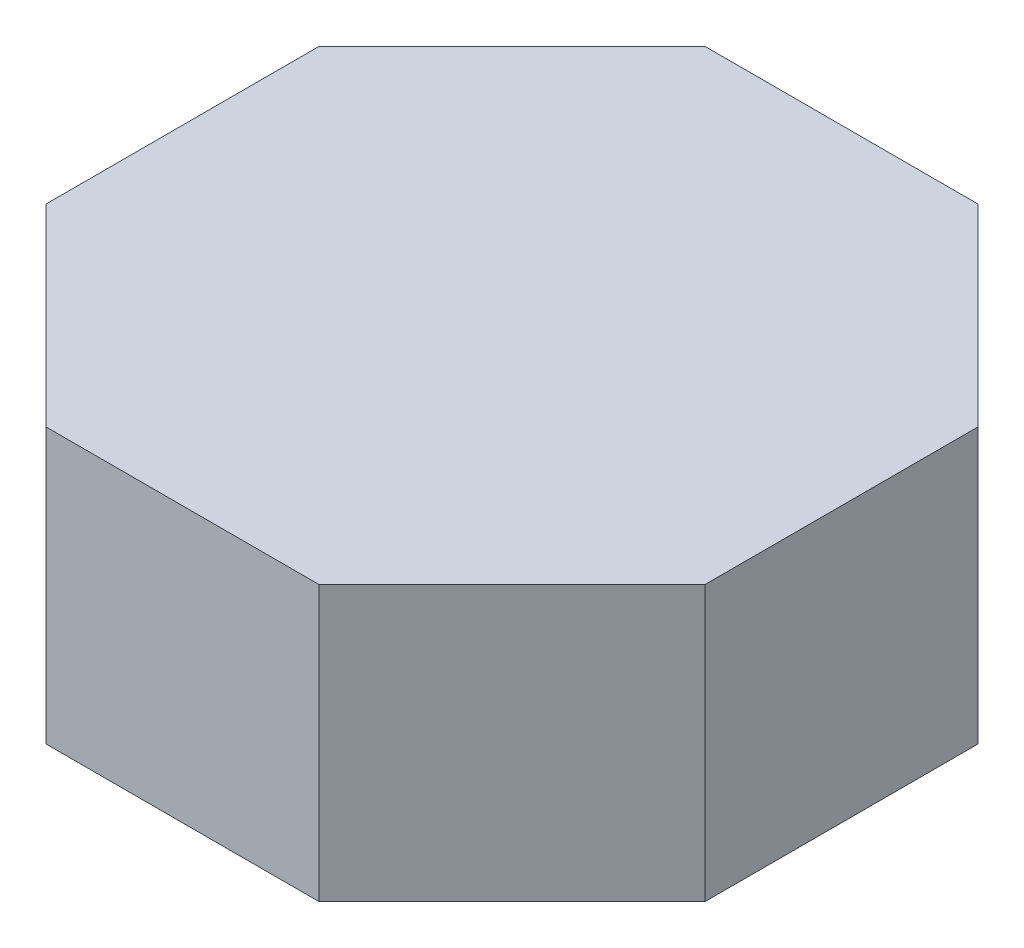
ISO-10303-21;
HEADER;
FILE_DESCRIPTION(('STEP AP214'),'2;1');
FILE_NAME('part.step','',(''),(''),'','','');
FILE_SCHEMA(('AUTOMOTIVE_DESIGN { 1 0 10303 214 1 1 1 1 }'));
ENDSEC;
DATA;
#1=APPLICATION_CONTEXT('core data for automotive mechanical design processes');
#2=APPLICATION_PROTOCOL_DEFINITION('international standard','automotive_design',2000,#1);
#3=PRODUCT_CONTEXT('',#1,'mechanical');
#4=PRODUCT('Part','Part','',(#3));
#5=PRODUCT_RELATED_PRODUCT_CATEGORY('part','',(#4));
#6=PRODUCT_DEFINITION_FORMATION('','',#4);
#7=PRODUCT_DEFINITION_CONTEXT('part definition',#1,'design');
#8=PRODUCT_DEFINITION('design','',#6,#7);
#9=PRODUCT_DEFINITION_SHAPE('','',#8);
#10=(LENGTH_UNIT() NAMED_UNIT(*) SI_UNIT(.MILLI.,.METRE.));
#11=(NAMED_UNIT(*) PLANE_ANGLE_UNIT() SI_UNIT($,.RADIAN.));
#12=(NAMED_UNIT(*) SI_UNIT($,.STERADIAN.) SOLID_ANGLE_UNIT());
#13=UNCERTAINTY_MEASURE_WITH_UNIT(LENGTH_MEASURE(1.E-05),#10,'distance_accuracy_value','');
#14=(GEOMETRIC_REPRESENTATION_CONTEXT(3) GLOBAL_UNCERTAINTY_ASSIGNED_CONTEXT((#13)) GLOBAL_UNIT_ASSIGNED_CONTEXT((#10,
#11,#12)) REPRESENTATION_CONTEXT('',''));
#15=CARTESIAN_POINT('',(0.,0.,0.));
#16=DIRECTION('',(0.,0.,1.));
#17=DIRECTION('',(1.,0.,0.));
#18=AXIS2_PLACEMENT_3D('',#15,#16,#17);
#19=CARTESIAN_POINT('',(124.264068711929,250.,300.));
#20=DIRECTION('',(-0.707106781186548,0.,-0.707106781186547));
#21=DIRECTION('',(-0.707106781186547,0.,0.707106781186548));
#22=AXIS2_PLACEMENT_3D('',#19,#20,#21);
#23=PLANE('',#22);
#24=DIRECTION('',(0.707106781186547,0.,-0.707106781186548));
#25=VECTOR('',#24,1.);
#26=CARTESIAN_POINT('',(124.264068711929,0.,300.));
#27=LINE('',#26,#25);
#28=CARTESIAN_POINT('',(124.264068711929,0.,300.));
#29=VERTEX_POINT('',#28);
#30=CARTESIAN_POINT('',(300.,0.,124.264068711929));
#31=VERTEX_POINT('',#30);
#32=EDGE_CURVE('E140',#29,#31,#27,.T.);
#33=ORIENTED_EDGE('',*,*,#32,.T.);
#34=DIRECTION('',(0.,-1.,0.));
#35=VECTOR('',#34,1.);
#36=CARTESIAN_POINT('',(300.,250.,124.264068711929));
#37=LINE('',#36,#35);
#38=CARTESIAN_POINT('',(300.,250.,124.264068711929));
#39=VERTEX_POINT('',#38);
#40=EDGE_CURVE('E11',#39,#31,#37,.T.);
#41=ORIENTED_EDGE('',*,*,#40,.F.);
#42=DIRECTION('',(0.707106781186547,0.,-0.707106781186548));
#43=VECTOR('',#42,1.);
#44=CARTESIAN_POINT('',(124.264068711929,250.,300.));
#45=LINE('',#44,#43);
#46=CARTESIAN_POINT('',(124.264068711929,250.,300.));
#47=VERTEX_POINT('',#46);
#48=EDGE_CURVE('E162',#47,#39,#45,.T.);
#49=ORIENTED_EDGE('',*,*,#48,.F.);
#50=DIRECTION('',(0.,-1.,0.));
#51=VECTOR('',#50,1.);
#52=CARTESIAN_POINT('',(124.264068711929,250.,300.));
#53=LINE('',#52,#51);
#54=EDGE_CURVE('E136',#47,#29,#53,.T.);
#55=ORIENTED_EDGE('',*,*,#54,.T.);
#56=EDGE_LOOP('',(#33,#41,#49,#55));
#57=FACE_BOUND('',#56,.T.);
#58=ADVANCED_FACE('F39',(#57),#23,.F.);
#59=CARTESIAN_POINT('',(300.,250.,124.264068711929));
#60=DIRECTION('',(-1.,0.,0.));
#61=DIRECTION('',(0.,0.,1.));
#62=AXIS2_PLACEMENT_3D('',#59,#60,#61);
#63=PLANE('',#62);
#64=DIRECTION('',(0.,0.,-1.));
#65=VECTOR('',#64,1.);
#66=CARTESIAN_POINT('',(300.,0.,124.264068711929));
#67=LINE('',#66,#65);
#68=CARTESIAN_POINT('',(300.,0.,-124.264068711929));
#69=VERTEX_POINT('',#68);
#70=EDGE_CURVE('E144',#31,#69,#67,.T.);
#71=ORIENTED_EDGE('',*,*,#70,.T.);
#72=DIRECTION('',(0.,-1.,0.));
#73=VECTOR('',#72,1.);
#74=CARTESIAN_POINT('',(300.,250.,-124.264068711929));
#75=LINE('',#74,#73);
#76=CARTESIAN_POINT('',(300.,250.,-124.264068711929));
#77=VERTEX_POINT('',#76);
#78=EDGE_CURVE('E48',#77,#69,#75,.T.);
#79=ORIENTED_EDGE('',*,*,#78,.F.);
#80=DIRECTION('',(0.,0.,-1.));
#81=VECTOR('',#80,1.);
#82=CARTESIAN_POINT('',(300.,250.,124.264068711929));
#83=LINE('',#82,#81);
#84=EDGE_CURVE('E99',#39,#77,#83,.T.);
#85=ORIENTED_EDGE('',*,*,#84,.F.);
#86=ORIENTED_EDGE('',*,*,#40,.T.);
#87=EDGE_LOOP('',(#71,#79,#85,#86));
#88=FACE_BOUND('',#87,.T.);
#89=ADVANCED_FACE('F208',(#88),#63,.F.);
#90=CARTESIAN_POINT('',(300.,250.,-124.264068711929));
#91=DIRECTION('',(-0.707106781186547,0.,0.707106781186548));
#92=DIRECTION('',(0.707106781186548,0.,0.707106781186547));
#93=AXIS2_PLACEMENT_3D('',#90,#91,#92);
#94=PLANE('',#93);
#95=DIRECTION('',(-0.707106781186548,0.,-0.707106781186547));
#96=VECTOR('',#95,1.);
#97=CARTESIAN_POINT('',(300.,0.,-124.264068711929));
#98=LINE('',#97,#96);
#99=CARTESIAN_POINT('',(124.264068711928,0.,-300.));
#100=VERTEX_POINT('',#99);
#101=EDGE_CURVE('E147',#69,#100,#98,.T.);
#102=ORIENTED_EDGE('',*,*,#101,.T.);
#103=DIRECTION('',(0.,-1.,0.));
#104=VECTOR('',#103,1.);
#105=CARTESIAN_POINT('',(124.264068711928,250.,-300.));
#106=LINE('',#105,#104);
#107=CARTESIAN_POINT('',(124.264068711928,250.,-300.));
#108=VERTEX_POINT('',#107);
#109=EDGE_CURVE('E173',#108,#100,#106,.T.);
#110=ORIENTED_EDGE('',*,*,#109,.F.);
#111=DIRECTION('',(-0.707106781186548,0.,-0.707106781186547));
#112=VECTOR('',#111,1.);
#113=CARTESIAN_POINT('',(300.,250.,-124.264068711929));
#114=LINE('',#113,#112);
#115=EDGE_CURVE('E183',#77,#108,#114,.T.);
#116=ORIENTED_EDGE('',*,*,#115,.F.);
#117=ORIENTED_EDGE('',*,*,#78,.T.);
#118=EDGE_LOOP('',(#102,#110,#116,#117));
#119=FACE_BOUND('',#118,.T.);
#120=ADVANCED_FACE('F181',(#119),#94,.F.);
#121=CARTESIAN_POINT('',(124.264068711928,250.,-300.));
#122=DIRECTION('',(0.,0.,1.));
#123=DIRECTION('',(1.,0.,0.));
#124=AXIS2_PLACEMENT_3D('',#121,#122,#123);
#125=PLANE('',#124);
#126=DIRECTION('',(-1.,0.,0.));
#127=VECTOR('',#126,1.);
#128=CARTESIAN_POINT('',(124.264068711928,0.,-300.));
#129=LINE('',#128,#127);
#130=CARTESIAN_POINT('',(-124.264068711929,0.,-300.));
#131=VERTEX_POINT('',#130);
#132=EDGE_CURVE('E150',#100,#131,#129,.T.);
#133=ORIENTED_EDGE('',*,*,#132,.T.);
#134=DIRECTION('',(0.,-1.,0.));
#135=VECTOR('',#134,1.);
#136=CARTESIAN_POINT('',(-124.264068711929,250.,-300.));
#137=LINE('',#136,#135);
#138=CARTESIAN_POINT('',(-124.264068711929,250.,-300.));
#139=VERTEX_POINT('',#138);
#140=EDGE_CURVE('E169',#139,#131,#137,.T.);
#141=ORIENTED_EDGE('',*,*,#140,.F.);
#142=DIRECTION('',(-1.,0.,0.));
#143=VECTOR('',#142,1.);
#144=CARTESIAN_POINT('',(124.264068711928,250.,-300.));
#145=LINE('',#144,#143);
#146=EDGE_CURVE('E196',#108,#139,#145,.T.);
#147=ORIENTED_EDGE('',*,*,#146,.F.);
#148=ORIENTED_EDGE('',*,*,#109,.T.);
#149=EDGE_LOOP('',(#133,#141,#147,#148));
#150=FACE_BOUND('',#149,.T.);
#151=ADVANCED_FACE('F191',(#150),#125,.F.);
#152=CARTESIAN_POINT('',(-124.264068711929,250.,-300.));
#153=DIRECTION('',(0.707106781186548,0.,0.707106781186547));
#154=DIRECTION('',(0.707106781186547,0.,-0.707106781186548));
#155=AXIS2_PLACEMENT_3D('',#152,#153,#154);
#156=PLANE('',#155);
#157=DIRECTION('',(-0.707106781186547,0.,0.707106781186548));
#158=VECTOR('',#157,1.);
#159=CARTESIAN_POINT('',(-124.264068711929,0.,-300.));
#160=LINE('',#159,#158);
#161=CARTESIAN_POINT('',(-300.,0.,-124.264068711928));
#162=VERTEX_POINT('',#161);
#163=EDGE_CURVE('E153',#131,#162,#160,.T.);
#164=ORIENTED_EDGE('',*,*,#163,.T.);
#165=DIRECTION('',(0.,-1.,0.));
#166=VECTOR('',#165,1.);
#167=CARTESIAN_POINT('',(-300.,250.,-124.264068711928));
#168=LINE('',#167,#166);
#169=CARTESIAN_POINT('',(-300.,250.,-124.264068711928));
#170=VERTEX_POINT('',#169);
#171=EDGE_CURVE('E129',#170,#162,#168,.T.);
#172=ORIENTED_EDGE('',*,*,#171,.F.);
#173=DIRECTION('',(-0.707106781186547,0.,0.707106781186548));
#174=VECTOR('',#173,1.);
#175=CARTESIAN_POINT('',(-124.264068711929,250.,-300.));
#176=LINE('',#175,#174);
#177=EDGE_CURVE('E118',#139,#170,#176,.T.);
#178=ORIENTED_EDGE('',*,*,#177,.F.);
#179=ORIENTED_EDGE('',*,*,#140,.T.);
#180=EDGE_LOOP('',(#164,#172,#178,#179));
#181=FACE_BOUND('',#180,.T.);
#182=ADVANCED_FACE('F194',(#181),#156,.F.);
#183=CARTESIAN_POINT('',(-300.,250.,-124.264068711928));
#184=DIRECTION('',(1.,0.,0.));
#185=DIRECTION('',(0.,0.,-1.));
#186=AXIS2_PLACEMENT_3D('',#183,#184,#185);
#187=PLANE('',#186);
#188=DIRECTION('',(0.,0.,1.));
#189=VECTOR('',#188,1.);
#190=CARTESIAN_POINT('',(-300.,0.,-124.264068711928));
#191=LINE('',#190,#189);
#192=CARTESIAN_POINT('',(-300.,0.,124.264068711929));
#193=VERTEX_POINT('',#192);
#194=EDGE_CURVE('E127',#162,#193,#191,.T.);
#195=ORIENTED_EDGE('',*,*,#194,.T.);
#196=DIRECTION('',(0.,-1.,0.));
#197=VECTOR('',#196,1.);
#198=CARTESIAN_POINT('',(-300.,250.,124.264068711929));
#199=LINE('',#198,#197);
#200=CARTESIAN_POINT('',(-300.,250.,124.264068711929));
#201=VERTEX_POINT('',#200);
#202=EDGE_CURVE('E124',#201,#193,#199,.T.);
#203=ORIENTED_EDGE('',*,*,#202,.F.);
#204=DIRECTION('',(0.,0.,1.));
#205=VECTOR('',#204,1.);
#206=CARTESIAN_POINT('',(-300.,250.,-124.264068711928));
#207=LINE('',#206,#205);
#208=EDGE_CURVE('E112',#170,#201,#207,.T.);
#209=ORIENTED_EDGE('',*,*,#208,.F.);
#210=ORIENTED_EDGE('',*,*,#171,.T.);
#211=EDGE_LOOP('',(#195,#203,#209,#210));
#212=FACE_BOUND('',#211,.T.);
#213=ADVANCED_FACE('F125',(#212),#187,.F.);
#214=CARTESIAN_POINT('',(-300.,250.,124.264068711929));
#215=DIRECTION('',(0.707106781186547,0.,-0.707106781186548));
#216=DIRECTION('',(-0.707106781186548,0.,-0.707106781186547));
#217=AXIS2_PLACEMENT_3D('',#214,#215,#216);
#218=PLANE('',#217);
#219=DIRECTION('',(0.707106781186548,0.,0.707106781186547));
#220=VECTOR('',#219,1.);
#221=CARTESIAN_POINT('',(-300.,0.,124.264068711929));
#222=LINE('',#221,#220);
#223=CARTESIAN_POINT('',(-124.264068711929,0.,300.));
#224=VERTEX_POINT('',#223);
#225=EDGE_CURVE('E85',#193,#224,#222,.T.);
#226=ORIENTED_EDGE('',*,*,#225,.T.);
#227=DIRECTION('',(0.,-1.,0.));
#228=VECTOR('',#227,1.);
#229=CARTESIAN_POINT('',(-124.264068711929,250.,300.));
#230=LINE('',#229,#228);
#231=CARTESIAN_POINT('',(-124.264068711929,250.,300.));
#232=VERTEX_POINT('',#231);
#233=EDGE_CURVE('E130',#232,#224,#230,.T.);
#234=ORIENTED_EDGE('',*,*,#233,.F.);
#235=DIRECTION('',(0.707106781186548,0.,0.707106781186547));
#236=VECTOR('',#235,1.);
#237=CARTESIAN_POINT('',(-300.,250.,124.264068711929));
#238=LINE('',#237,#236);
#239=EDGE_CURVE('E116',#201,#232,#238,.T.);
#240=ORIENTED_EDGE('',*,*,#239,.F.);
#241=ORIENTED_EDGE('',*,*,#202,.T.);
#242=EDGE_LOOP('',(#226,#234,#240,#241));
#243=FACE_BOUND('',#242,.T.);
#244=ADVANCED_FACE('F132',(#243),#218,.F.);
#245=CARTESIAN_POINT('',(-124.264068711929,250.,300.));
#246=DIRECTION('',(0.,0.,-1.));
#247=DIRECTION('',(-1.,0.,0.));
#248=AXIS2_PLACEMENT_3D('',#245,#246,#247);
#249=PLANE('',#248);
#250=DIRECTION('',(1.,0.,0.));
#251=VECTOR('',#250,1.);
#252=CARTESIAN_POINT('',(-124.264068711929,0.,300.));
#253=LINE('',#252,#251);
#254=EDGE_CURVE('E91',#224,#29,#253,.T.);
#255=ORIENTED_EDGE('',*,*,#254,.T.);
#256=ORIENTED_EDGE('',*,*,#54,.F.);
#257=DIRECTION('',(1.,0.,0.));
#258=VECTOR('',#257,1.);
#259=CARTESIAN_POINT('',(-124.264068711929,250.,300.));
#260=LINE('',#259,#258);
#261=EDGE_CURVE('E56',#232,#47,#260,.T.);
#262=ORIENTED_EDGE('',*,*,#261,.F.);
#263=ORIENTED_EDGE('',*,*,#233,.T.);
#264=EDGE_LOOP('',(#255,#256,#262,#263));
#265=FACE_BOUND('',#264,.T.);
#266=ADVANCED_FACE('F224',(#265),#249,.F.);
#267=CARTESIAN_POINT('',(0.,250.,0.));
#268=DIRECTION('',(0.,1.,0.));
#269=DIRECTION('',(0.,0.,1.));
#270=AXIS2_PLACEMENT_3D('',#267,#268,#269);
#271=PLANE('',#270);
#272=ORIENTED_EDGE('',*,*,#48,.T.);
#273=ORIENTED_EDGE('',*,*,#84,.T.);
#274=ORIENTED_EDGE('',*,*,#115,.T.);
#275=ORIENTED_EDGE('',*,*,#146,.T.);
#276=ORIENTED_EDGE('',*,*,#177,.T.);
#277=ORIENTED_EDGE('',*,*,#208,.T.);
#278=ORIENTED_EDGE('',*,*,#239,.T.);
#279=ORIENTED_EDGE('',*,*,#261,.T.);
#280=EDGE_LOOP('',(#272,#273,#274,#275,#276,#277,#278,#279));
#281=FACE_BOUND('',#280,.T.);
#282=ADVANCED_FACE('F114',(#281),#271,.T.);
#283=CARTESIAN_POINT('',(0.,0.,0.));
#284=DIRECTION('',(0.,1.,0.));
#285=DIRECTION('',(0.,0.,1.));
#286=AXIS2_PLACEMENT_3D('',#283,#284,#285);
#287=PLANE('',#286);
#288=ORIENTED_EDGE('',*,*,#32,.F.);
#289=ORIENTED_EDGE('',*,*,#254,.F.);
#290=ORIENTED_EDGE('',*,*,#225,.F.);
#291=ORIENTED_EDGE('',*,*,#194,.F.);
#292=ORIENTED_EDGE('',*,*,#163,.F.);
#293=ORIENTED_EDGE('',*,*,#132,.F.);
#294=ORIENTED_EDGE('',*,*,#101,.F.);
#295=ORIENTED_EDGE('',*,*,#70,.F.);
#296=EDGE_LOOP('',(#288,#289,#290,#291,#292,#293,#294,#295));
#297=FACE_BOUND('',#296,.T.);
#298=ADVANCED_FACE('F187',(#297),#287,.F.);
#299=CLOSED_SHELL('',(#58,#89,#120,#151,#182,#213,#244,#266,#282,#298));
#300=MANIFOLD_SOLID_BREP('B2',#299);
#301=ADVANCED_BREP_SHAPE_REPRESENTATION('',(#18,#300),#14);
#302=SHAPE_DEFINITION_REPRESENTATION(#9,#301);
ENDSEC;
END-ISO-10303-21;
